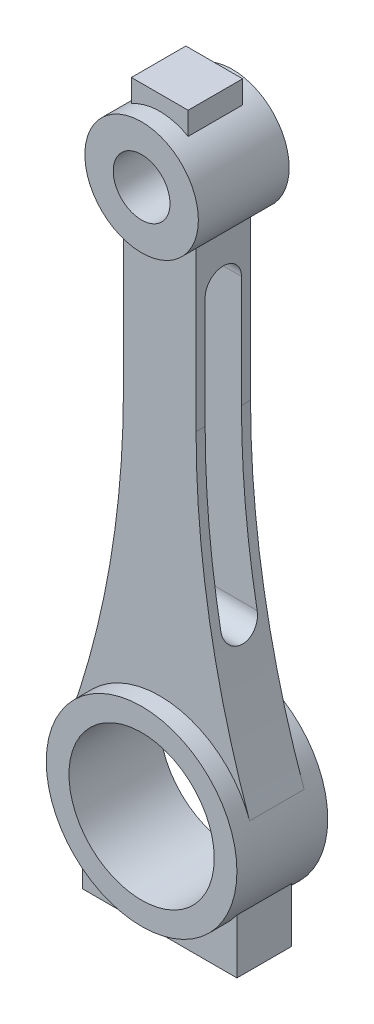
ISO-10303-21;
HEADER;
FILE_DESCRIPTION(('STEP AP214'),'2;1');
FILE_NAME('part.step','',(''),(''),'','','');
FILE_SCHEMA(('AUTOMOTIVE_DESIGN { 1 0 10303 214 1 1 1 1 }'));
ENDSEC;
DATA;
#1=APPLICATION_CONTEXT('core data for automotive mechanical design processes');
#2=APPLICATION_PROTOCOL_DEFINITION('international standard','automotive_design',2000,#1);
#3=PRODUCT_CONTEXT('',#1,'mechanical');
#4=PRODUCT('Part','Part','',(#3));
#5=PRODUCT_RELATED_PRODUCT_CATEGORY('part','',(#4));
#6=PRODUCT_DEFINITION_FORMATION('','',#4);
#7=PRODUCT_DEFINITION_CONTEXT('part definition',#1,'design');
#8=PRODUCT_DEFINITION('design','',#6,#7);
#9=PRODUCT_DEFINITION_SHAPE('','',#8);
#10=(LENGTH_UNIT() NAMED_UNIT(*) SI_UNIT(.MILLI.,.METRE.));
#11=(NAMED_UNIT(*) PLANE_ANGLE_UNIT() SI_UNIT($,.RADIAN.));
#12=(NAMED_UNIT(*) SI_UNIT($,.STERADIAN.) SOLID_ANGLE_UNIT());
#13=UNCERTAINTY_MEASURE_WITH_UNIT(LENGTH_MEASURE(1.E-05),#10,'distance_accuracy_value','');
#14=(GEOMETRIC_REPRESENTATION_CONTEXT(3) GLOBAL_UNCERTAINTY_ASSIGNED_CONTEXT((#13)) GLOBAL_UNIT_ASSIGNED_CONTEXT((#10,
#11,#12)) REPRESENTATION_CONTEXT('',''));
#15=CARTESIAN_POINT('',(0.,0.,0.));
#16=DIRECTION('',(0.,0.,1.));
#17=DIRECTION('',(1.,0.,0.));
#18=AXIS2_PLACEMENT_3D('',#15,#16,#17);
#19=CARTESIAN_POINT('',(0.,0.,10.));
#20=DIRECTION('',(0.,0.,-1.));
#21=DIRECTION('',(-1.,0.,0.));
#22=AXIS2_PLACEMENT_3D('',#19,#20,#21);
#23=CYLINDRICAL_SURFACE('',#22,16.);
#24=CARTESIAN_POINT('',(0.,0.,10.));
#25=DIRECTION('',(0.,0.,1.));
#26=DIRECTION('',(1.,0.,0.));
#27=AXIS2_PLACEMENT_3D('',#24,#25,#26);
#28=CIRCLE('',#27,16.);
#29=CARTESIAN_POINT('',(16.,0.,10.));
#30=VERTEX_POINT('',#29);
#31=EDGE_CURVE('E264',#30,#30,#28,.T.);
#32=ORIENTED_EDGE('',*,*,#31,.T.);
#33=EDGE_LOOP('',(#32));
#34=FACE_BOUND('',#33,.T.);
#35=CARTESIAN_POINT('',(0.,0.,-10.));
#36=DIRECTION('',(0.,0.,1.));
#37=DIRECTION('',(1.,0.,0.));
#38=AXIS2_PLACEMENT_3D('',#35,#36,#37);
#39=CIRCLE('',#38,16.);
#40=CARTESIAN_POINT('',(16.,0.,-10.));
#41=VERTEX_POINT('',#40);
#42=EDGE_CURVE('E267',#41,#41,#39,.T.);
#43=ORIENTED_EDGE('',*,*,#42,.F.);
#44=EDGE_LOOP('',(#43));
#45=FACE_BOUND('',#44,.T.);
#46=ADVANCED_FACE('F41',(#34,#45),#23,.F.);
#47=CARTESIAN_POINT('',(0.,0.,10.));
#48=DIRECTION('',(0.,0.,-1.));
#49=DIRECTION('',(-1.,0.,0.));
#50=AXIS2_PLACEMENT_3D('',#47,#48,#49);
#51=CYLINDRICAL_SURFACE('',#50,21.);
#52=DIRECTION('',(0.,0.,-1.));
#53=VECTOR('',#52,1.);
#54=CARTESIAN_POINT('',(-17.,-12.328828005938,6.));
#55=LINE('',#54,#53);
#56=CARTESIAN_POINT('',(-17.,-12.328828005938,6.));
#57=VERTEX_POINT('',#56);
#58=CARTESIAN_POINT('',(-17.,-12.328828005938,-6.));
#59=VERTEX_POINT('',#58);
#60=EDGE_CURVE('E398',#57,#59,#55,.T.);
#61=ORIENTED_EDGE('',*,*,#60,.F.);
#62=CARTESIAN_POINT('',(0.,0.,6.));
#63=DIRECTION('',(0.,0.,1.));
#64=DIRECTION('',(1.,0.,0.));
#65=AXIS2_PLACEMENT_3D('',#62,#63,#64);
#66=CIRCLE('',#65,21.);
#67=CARTESIAN_POINT('',(17.,-12.3288280059379,6.));
#68=VERTEX_POINT('',#67);
#69=EDGE_CURVE('E430',#57,#68,#66,.T.);
#70=ORIENTED_EDGE('',*,*,#69,.T.);
#71=DIRECTION('',(0.,0.,-1.));
#72=VECTOR('',#71,1.);
#73=CARTESIAN_POINT('',(17.,-12.328828005938,6.));
#74=LINE('',#73,#72);
#75=CARTESIAN_POINT('',(17.,-12.328828005938,-6.));
#76=VERTEX_POINT('',#75);
#77=EDGE_CURVE('E422',#68,#76,#74,.T.);
#78=ORIENTED_EDGE('',*,*,#77,.T.);
#79=CARTESIAN_POINT('',(0.,0.,-6.));
#80=DIRECTION('',(0.,0.,1.));
#81=DIRECTION('',(1.,0.,0.));
#82=AXIS2_PLACEMENT_3D('',#79,#80,#81);
#83=CIRCLE('',#82,21.);
#84=EDGE_CURVE('E438',#59,#76,#83,.T.);
#85=ORIENTED_EDGE('',*,*,#84,.F.);
#86=EDGE_LOOP('',(#61,#70,#78,#85));
#87=FACE_BOUND('',#86,.T.);
#88=DIRECTION('',(0.,0.,-1.));
#89=VECTOR('',#88,1.);
#90=CARTESIAN_POINT('',(19.7873824881444,7.03274443356765,6.));
#91=LINE('',#90,#89);
#92=CARTESIAN_POINT('',(19.7873824881444,7.03274443356766,6.));
#93=VERTEX_POINT('',#92);
#94=CARTESIAN_POINT('',(19.7873824881444,7.03274443356765,-6.));
#95=VERTEX_POINT('',#94);
#96=EDGE_CURVE('E271',#93,#95,#91,.T.);
#97=ORIENTED_EDGE('',*,*,#96,.F.);
#98=CARTESIAN_POINT('',(0.,0.,6.));
#99=DIRECTION('',(0.,0.,1.));
#100=DIRECTION('',(1.,0.,0.));
#101=AXIS2_PLACEMENT_3D('',#98,#99,#100);
#102=CIRCLE('',#101,21.);
#103=CARTESIAN_POINT('',(-19.7873824881444,7.03274443356765,6.));
#104=VERTEX_POINT('',#103);
#105=EDGE_CURVE('E309',#93,#104,#102,.T.);
#106=ORIENTED_EDGE('',*,*,#105,.T.);
#107=DIRECTION('',(0.,0.,-1.));
#108=VECTOR('',#107,1.);
#109=CARTESIAN_POINT('',(-19.7873824881444,7.03274443356764,6.));
#110=LINE('',#109,#108);
#111=CARTESIAN_POINT('',(-19.7873824881444,7.03274443356764,-6.));
#112=VERTEX_POINT('',#111);
#113=EDGE_CURVE('E301',#104,#112,#110,.T.);
#114=ORIENTED_EDGE('',*,*,#113,.T.);
#115=CARTESIAN_POINT('',(0.,0.,-6.));
#116=DIRECTION('',(0.,0.,1.));
#117=DIRECTION('',(1.,0.,0.));
#118=AXIS2_PLACEMENT_3D('',#115,#116,#117);
#119=CIRCLE('',#118,21.);
#120=EDGE_CURVE('E326',#95,#112,#119,.T.);
#121=ORIENTED_EDGE('',*,*,#120,.F.);
#122=EDGE_LOOP('',(#97,#106,#114,#121));
#123=FACE_BOUND('',#122,.T.);
#124=CARTESIAN_POINT('',(0.,0.,10.));
#125=DIRECTION('',(0.,0.,1.));
#126=DIRECTION('',(1.,0.,0.));
#127=AXIS2_PLACEMENT_3D('',#124,#125,#126);
#128=CIRCLE('',#127,21.);
#129=CARTESIAN_POINT('',(21.,0.,10.));
#130=VERTEX_POINT('',#129);
#131=EDGE_CURVE('E280',#130,#130,#128,.T.);
#132=ORIENTED_EDGE('',*,*,#131,.F.);
#133=EDGE_LOOP('',(#132));
#134=FACE_BOUND('',#133,.T.);
#135=CARTESIAN_POINT('',(0.,0.,-10.));
#136=DIRECTION('',(0.,0.,1.));
#137=DIRECTION('',(1.,0.,0.));
#138=AXIS2_PLACEMENT_3D('',#135,#136,#137);
#139=CIRCLE('',#138,21.);
#140=CARTESIAN_POINT('',(21.,0.,-10.));
#141=VERTEX_POINT('',#140);
#142=EDGE_CURVE('E270',#141,#141,#139,.T.);
#143=ORIENTED_EDGE('',*,*,#142,.T.);
#144=EDGE_LOOP('',(#143));
#145=FACE_BOUND('',#144,.T.);
#146=ADVANCED_FACE('F254',(#87,#123,#134,#145),#51,.T.);
#147=CARTESIAN_POINT('',(0.,0.,10.));
#148=DIRECTION('',(0.,0.,1.));
#149=DIRECTION('',(1.,0.,0.));
#150=AXIS2_PLACEMENT_3D('',#147,#148,#149);
#151=PLANE('',#150);
#152=ORIENTED_EDGE('',*,*,#31,.F.);
#153=EDGE_LOOP('',(#152));
#154=FACE_BOUND('',#153,.T.);
#155=ORIENTED_EDGE('',*,*,#131,.T.);
#156=EDGE_LOOP('',(#155));
#157=FACE_BOUND('',#156,.T.);
#158=ADVANCED_FACE('F259',(#154,#157),#151,.T.);
#159=CARTESIAN_POINT('',(0.,0.,-10.));
#160=DIRECTION('',(0.,0.,1.));
#161=DIRECTION('',(1.,0.,0.));
#162=AXIS2_PLACEMENT_3D('',#159,#160,#161);
#163=PLANE('',#162);
#164=ORIENTED_EDGE('',*,*,#42,.T.);
#165=EDGE_LOOP('',(#164));
#166=FACE_BOUND('',#165,.T.);
#167=ORIENTED_EDGE('',*,*,#142,.F.);
#168=EDGE_LOOP('',(#167));
#169=FACE_BOUND('',#168,.T.);
#170=ADVANCED_FACE('F251',(#166,#169),#163,.F.);
#171=CARTESIAN_POINT('',(212.132819979024,75.3953136438508,6.));
#172=DIRECTION('',(0.,0.,-1.));
#173=DIRECTION('',(-1.,0.,0.));
#174=AXIS2_PLACEMENT_3D('',#171,#172,#173);
#175=CYLINDRICAL_SURFACE('',#174,204.132819979024);
#176=CARTESIAN_POINT('',(212.132819979024,75.3953136438508,-4.));
#177=DIRECTION('',(0.,0.,-1.));
#178=DIRECTION('',(0.,1.,0.));
#179=AXIS2_PLACEMENT_3D('',#176,#177,#178);
#180=CIRCLE('',#179,204.132819979024);
#181=CARTESIAN_POINT('',(11.4544735884215,38.,-4.00000000000001));
#182=VERTEX_POINT('',#181);
#183=CARTESIAN_POINT('',(8.00000000000002,75.3953136438507,-4.));
#184=VERTEX_POINT('',#183);
#185=EDGE_CURVE('E197',#182,#184,#180,.T.);
#186=ORIENTED_EDGE('',*,*,#185,.F.);
#187=CARTESIAN_POINT('',(11.4544735884215,38.,3.99999999999999));
#188=CARTESIAN_POINT('',(11.4757515518411,37.8858086335559,4.00000967356234));
#189=CARTESIAN_POINT('',(11.497127848932,37.7716411229783,3.99511012112078));
#190=CARTESIAN_POINT('',(11.5399210356049,37.544152772884,3.97557755361703));
#191=CARTESIAN_POINT('',(11.5613379239584,37.4308319082382,3.96094482861378));
#192=CARTESIAN_POINT('',(11.6040518019029,37.2058589467753,3.92203609087537));
#193=CARTESIAN_POINT('',(11.6253488219803,37.0942064124742,3.89776265395076));
#194=CARTESIAN_POINT('',(11.6676599337569,36.8733657612217,3.83975872762629));
#195=CARTESIAN_POINT('',(11.688674029376,36.7641776101131,3.80602836938935));
#196=CARTESIAN_POINT('',(11.7510730473326,36.4413470108117,3.69089420326937));
#197=CARTESIAN_POINT('',(11.7918289081029,36.2323636826891,3.59553432969806));
#198=CARTESIAN_POINT('',(11.8702126062764,35.833491871712,3.37027556179512));
#199=CARTESIAN_POINT('',(11.9078413597511,35.643597793309,3.24038682968161));
#200=CARTESIAN_POINT('',(11.9784728244352,35.2894796680367,2.95043691024398));
#201=CARTESIAN_POINT('',(12.0115036519544,35.1250988255321,2.79057453802654));
#202=CARTESIAN_POINT('',(12.0720036427705,34.8256035029566,2.44449926104123));
#203=CARTESIAN_POINT('',(12.0994724370193,34.6904909648341,2.25828460915732));
#204=CARTESIAN_POINT('',(12.1473413477104,34.4559602912754,1.86832249559896));
#205=CARTESIAN_POINT('',(12.1678582991115,34.3559510460777,1.664944991045));
#206=CARTESIAN_POINT('',(12.201667760202,34.1915558050773,1.24372237948286));
#207=CARTESIAN_POINT('',(12.2149615713728,34.1271633917176,1.0258798867516));
#208=CARTESIAN_POINT('',(12.2336033492388,34.0369591960168,0.586274812122694));
#209=CARTESIAN_POINT('',(12.2390950212482,34.0104496060439,0.364661335561843));
#210=CARTESIAN_POINT('',(12.2423732155319,33.9946184843632,-0.0799443502249533));
#211=CARTESIAN_POINT('',(12.2401601145853,34.0052951341723,-0.302936491499047));
#212=CARTESIAN_POINT('',(12.2281765408432,34.0632127244266,-0.741781925824328));
#213=CARTESIAN_POINT('',(12.2184766498272,34.1101121767816,-0.957682365575716));
#214=CARTESIAN_POINT('',(12.1919895794175,34.2385791029979,-1.37844153266759));
#215=CARTESIAN_POINT('',(12.1752023313576,34.3201469127454,-1.58330015300716));
#216=CARTESIAN_POINT('',(12.1350793834177,34.5159552856904,-1.97739776157501));
#217=CARTESIAN_POINT('',(12.1117098081663,34.6303649264094,-2.16654921549124));
#218=CARTESIAN_POINT('',(12.0593260749273,34.8882465100265,-2.52297125984128));
#219=CARTESIAN_POINT('',(12.0303117725959,35.0317191961119,-2.69024129055299));
#220=CARTESIAN_POINT('',(11.9671383735568,35.3461665633751,-3.00114206510915));
#221=CARTESIAN_POINT('',(11.9329025496515,35.5175545383741,-3.1443390498194));
#222=CARTESIAN_POINT('',(11.8607975408038,35.8812712267655,-3.40006280722766));
#223=CARTESIAN_POINT('',(11.8229268395298,36.0736086840292,-3.51257670427657));
#224=CARTESIAN_POINT('',(11.744011046999,36.4777513253325,-3.70593438635493));
#225=CARTESIAN_POINT('',(11.7029182624971,36.6898643551292,-3.78611370956409));
#226=CARTESIAN_POINT('',(11.619535719839,37.1241795414682,-3.90944320644276));
#227=CARTESIAN_POINT('',(11.5772477716993,37.3463667203578,-3.95264656840456));
#228=CARTESIAN_POINT('',(11.5215540274852,37.6417241762258,-3.98457340087696));
#229=CARTESIAN_POINT('',(11.5080944382149,37.713314753212,-3.9903611181727));
#230=CARTESIAN_POINT('',(11.4812368188341,37.8565916807734,-3.99806924003838));
#231=CARTESIAN_POINT('',(11.467838723541,37.9282776734255,-3.99999606757806));
#232=CARTESIAN_POINT('',(11.4544735884215,38.,-4.00000000000001));
#233=B_SPLINE_CURVE_WITH_KNOTS('',3,(#187,#188,#189,#190,#191,#192,#193,#194,#195,#196,#197,
#198,#199,#200,#201,#202,#203,#204,#205,#206,#207,#208,#209,#210,#211,#212,#213,#214,#215,#216,
#217,#218,#219,#220,#221,#222,#223,#224,#225,#226,#227,#228,#229,#230,#231,#232),.UNSPECIFIED.,
.F.,.F.,(4,2,2,2,2,2,2,2,2,2,2,2,2,2,2,2,2,2,2,2,2,2,4),(0.,0.348357600629768,0.696704820295746,
1.044959030908,1.39320841164154,2.0894785742732,2.78554404346983,3.47714614167072,
4.16879411353829,4.84816302804555,5.52740949173435,6.19397531687088,6.86050854603355,
7.52083364695974,8.18116514562693,8.84495910470897,9.508770040179,10.1834922182609,
10.8584970981523,11.546741507572,12.2339942357505,12.4531452672714,12.6719314158043),.UNSPECIFIED.);
#234=CARTESIAN_POINT('',(11.4544735884215,38.,3.99999999999999));
#235=VERTEX_POINT('',#234);
#236=EDGE_CURVE('E182',#235,#182,#233,.T.);
#237=ORIENTED_EDGE('',*,*,#236,.F.);
#238=CARTESIAN_POINT('',(212.132819979024,75.3953136438508,4.));
#239=DIRECTION('',(0.,0.,1.));
#240=DIRECTION('',(0.,-1.,0.));
#241=AXIS2_PLACEMENT_3D('',#238,#239,#240);
#242=CIRCLE('',#241,204.132819979024);
#243=CARTESIAN_POINT('',(8.00000000000002,75.3953136438507,4.));
#244=VERTEX_POINT('',#243);
#245=EDGE_CURVE('E174',#244,#235,#242,.T.);
#246=ORIENTED_EDGE('',*,*,#245,.F.);
#247=DIRECTION('',(0.,0.,-1.));
#248=VECTOR('',#247,1.);
#249=CARTESIAN_POINT('',(8.00000000000002,75.3953136438507,6.));
#250=LINE('',#249,#248);
#251=CARTESIAN_POINT('',(8.00000000000002,75.3953136438507,6.));
#252=VERTEX_POINT('',#251);
#253=EDGE_CURVE('E277',#252,#244,#250,.T.);
#254=ORIENTED_EDGE('',*,*,#253,.F.);
#255=CARTESIAN_POINT('',(212.132819979024,75.3953136438508,6.));
#256=DIRECTION('',(0.,0.,1.));
#257=DIRECTION('',(1.,0.,0.));
#258=AXIS2_PLACEMENT_3D('',#255,#256,#257);
#259=CIRCLE('',#258,204.132819979024);
#260=EDGE_CURVE('E345',#252,#93,#259,.T.);
#261=ORIENTED_EDGE('',*,*,#260,.T.);
#262=ORIENTED_EDGE('',*,*,#96,.T.);
#263=CARTESIAN_POINT('',(212.132819979024,75.3953136438508,-6.));
#264=DIRECTION('',(0.,0.,1.));
#265=DIRECTION('',(1.,0.,0.));
#266=AXIS2_PLACEMENT_3D('',#263,#264,#265);
#267=CIRCLE('',#266,204.132819979024);
#268=CARTESIAN_POINT('',(8.00000000000002,75.3953136438507,-6.));
#269=VERTEX_POINT('',#268);
#270=EDGE_CURVE('E322',#269,#95,#267,.T.);
#271=ORIENTED_EDGE('',*,*,#270,.F.);
#272=EDGE_CURVE('E288',#184,#269,#250,.T.);
#273=ORIENTED_EDGE('',*,*,#272,.F.);
#274=EDGE_LOOP('',(#186,#237,#246,#254,#261,#262,#271,#273));
#275=FACE_BOUND('',#274,.T.);
#276=ADVANCED_FACE('F195',(#275),#175,.F.);
#277=CARTESIAN_POINT('',(8.00000000000008,0.,6.));
#278=DIRECTION('',(-1.,0.,0.));
#279=DIRECTION('',(0.,-1.,0.));
#280=AXIS2_PLACEMENT_3D('',#277,#278,#279);
#281=PLANE('',#280);
#282=CARTESIAN_POINT('',(8.00000000000001,100.,0.));
#283=DIRECTION('',(-1.,0.,0.));
#284=DIRECTION('',(0.,-1.,0.));
#285=AXIS2_PLACEMENT_3D('',#282,#283,#284);
#286=CIRCLE('',#285,4.);
#287=CARTESIAN_POINT('',(8.00000000000001,100.,4.));
#288=VERTEX_POINT('',#287);
#289=CARTESIAN_POINT('',(8.00000000000001,100.,-4.));
#290=VERTEX_POINT('',#289);
#291=EDGE_CURVE('E442',#288,#290,#286,.T.);
#292=ORIENTED_EDGE('',*,*,#291,.T.);
#293=DIRECTION('',(0.,-1.,0.));
#294=VECTOR('',#293,1.);
#295=CARTESIAN_POINT('',(8.00000000000008,0.,-4.00000000000001));
#296=LINE('',#295,#294);
#297=EDGE_CURVE('E202',#290,#184,#296,.T.);
#298=ORIENTED_EDGE('',*,*,#297,.T.);
#299=ORIENTED_EDGE('',*,*,#272,.T.);
#300=DIRECTION('',(0.,1.,0.));
#301=VECTOR('',#300,1.);
#302=CARTESIAN_POINT('',(8.00000000000008,0.,-6.));
#303=LINE('',#302,#301);
#304=CARTESIAN_POINT('',(8.,110.395313643851,-6.));
#305=VERTEX_POINT('',#304);
#306=EDGE_CURVE('E318',#269,#305,#303,.T.);
#307=ORIENTED_EDGE('',*,*,#306,.T.);
#308=DIRECTION('',(0.,0.,-1.));
#309=VECTOR('',#308,1.);
#310=CARTESIAN_POINT('',(8.,110.395313643851,6.));
#311=LINE('',#310,#309);
#312=CARTESIAN_POINT('',(8.,110.395313643851,6.));
#313=VERTEX_POINT('',#312);
#314=EDGE_CURVE('E289',#313,#305,#311,.T.);
#315=ORIENTED_EDGE('',*,*,#314,.F.);
#316=DIRECTION('',(0.,1.,0.));
#317=VECTOR('',#316,1.);
#318=CARTESIAN_POINT('',(8.00000000000008,0.,6.));
#319=LINE('',#318,#317);
#320=EDGE_CURVE('E341',#252,#313,#319,.T.);
#321=ORIENTED_EDGE('',*,*,#320,.F.);
#322=ORIENTED_EDGE('',*,*,#253,.T.);
#323=DIRECTION('',(0.,1.,0.));
#324=VECTOR('',#323,1.);
#325=CARTESIAN_POINT('',(8.00000000000008,0.,3.99999999999999));
#326=LINE('',#325,#324);
#327=EDGE_CURVE('E177',#244,#288,#326,.T.);
#328=ORIENTED_EDGE('',*,*,#327,.T.);
#329=EDGE_LOOP('',(#292,#298,#299,#307,#315,#321,#322,#328));
#330=FACE_BOUND('',#329,.T.);
#331=ADVANCED_FACE('F244',(#330),#281,.F.);
#332=CARTESIAN_POINT('',(-8.00000000000004,0.,6.));
#333=DIRECTION('',(-1.,0.,0.));
#334=DIRECTION('',(0.,-1.,0.));
#335=AXIS2_PLACEMENT_3D('',#332,#333,#334);
#336=PLANE('',#335);
#337=DIRECTION('',(0.,-1.,0.));
#338=VECTOR('',#337,1.);
#339=CARTESIAN_POINT('',(-8.00000000000004,0.,-4.00000000000001));
#340=LINE('',#339,#338);
#341=CARTESIAN_POINT('',(-8.,100.,-4.));
#342=VERTEX_POINT('',#341);
#343=CARTESIAN_POINT('',(-7.99999999999995,75.3953136438507,-4.));
#344=VERTEX_POINT('',#343);
#345=EDGE_CURVE('E199',#342,#344,#340,.T.);
#346=ORIENTED_EDGE('',*,*,#345,.F.);
#347=CARTESIAN_POINT('',(-7.99999999999999,100.,0.));
#348=DIRECTION('',(-1.,0.,0.));
#349=DIRECTION('',(0.,-1.,0.));
#350=AXIS2_PLACEMENT_3D('',#347,#348,#349);
#351=CIRCLE('',#350,4.);
#352=CARTESIAN_POINT('',(-8.,100.,4.));
#353=VERTEX_POINT('',#352);
#354=EDGE_CURVE('E11',#353,#342,#351,.T.);
#355=ORIENTED_EDGE('',*,*,#354,.F.);
#356=DIRECTION('',(0.,1.,0.));
#357=VECTOR('',#356,1.);
#358=CARTESIAN_POINT('',(-8.00000000000004,0.,3.99999999999999));
#359=LINE('',#358,#357);
#360=CARTESIAN_POINT('',(-7.99999999999995,75.3953136438507,4.));
#361=VERTEX_POINT('',#360);
#362=EDGE_CURVE('E489',#361,#353,#359,.T.);
#363=ORIENTED_EDGE('',*,*,#362,.F.);
#364=DIRECTION('',(0.,0.,-1.));
#365=VECTOR('',#364,1.);
#366=CARTESIAN_POINT('',(-8.00000000000001,75.3953136438507,6.));
#367=LINE('',#366,#365);
#368=CARTESIAN_POINT('',(-8.00000000000001,75.3953136438507,6.));
#369=VERTEX_POINT('',#368);
#370=EDGE_CURVE('E296',#369,#361,#367,.T.);
#371=ORIENTED_EDGE('',*,*,#370,.F.);
#372=DIRECTION('',(0.,1.,0.));
#373=VECTOR('',#372,1.);
#374=CARTESIAN_POINT('',(-8.00000000000004,0.,6.));
#375=LINE('',#374,#373);
#376=CARTESIAN_POINT('',(-7.99999999999999,110.395313643851,6.));
#377=VERTEX_POINT('',#376);
#378=EDGE_CURVE('E334',#369,#377,#375,.T.);
#379=ORIENTED_EDGE('',*,*,#378,.T.);
#380=DIRECTION('',(0.,0.,-1.));
#381=VECTOR('',#380,1.);
#382=CARTESIAN_POINT('',(-7.99999999999999,110.395313643851,6.));
#383=LINE('',#382,#381);
#384=CARTESIAN_POINT('',(-7.99999999999999,110.395313643851,-6.));
#385=VERTEX_POINT('',#384);
#386=EDGE_CURVE('E292',#377,#385,#383,.T.);
#387=ORIENTED_EDGE('',*,*,#386,.T.);
#388=DIRECTION('',(0.,1.,0.));
#389=VECTOR('',#388,1.);
#390=CARTESIAN_POINT('',(-8.00000000000004,0.,-6.));
#391=LINE('',#390,#389);
#392=CARTESIAN_POINT('',(-8.00000000000001,75.3953136438507,-6.));
#393=VERTEX_POINT('',#392);
#394=EDGE_CURVE('E310',#393,#385,#391,.T.);
#395=ORIENTED_EDGE('',*,*,#394,.F.);
#396=EDGE_CURVE('E300',#344,#393,#367,.T.);
#397=ORIENTED_EDGE('',*,*,#396,.F.);
#398=EDGE_LOOP('',(#346,#355,#363,#371,#379,#387,#395,#397));
#399=FACE_BOUND('',#398,.T.);
#400=ADVANCED_FACE('F239',(#399),#336,.T.);
#401=CARTESIAN_POINT('',(-212.132819979024,75.3953136438507,6.));
#402=DIRECTION('',(0.,0.,-1.));
#403=DIRECTION('',(-1.,0.,0.));
#404=AXIS2_PLACEMENT_3D('',#401,#402,#403);
#405=CYLINDRICAL_SURFACE('',#404,204.132819979024);
#406=CARTESIAN_POINT('',(-11.4544735884215,38.,3.99999999999999));
#407=CARTESIAN_POINT('',(-11.4757515518411,37.8858086335559,4.00000967356234));
#408=CARTESIAN_POINT('',(-11.4971278489319,37.7716411229782,3.99511012112078));
#409=CARTESIAN_POINT('',(-11.5399210356049,37.5441527728839,3.97557755361703));
#410=CARTESIAN_POINT('',(-11.5613379239584,37.4308319082382,3.96094482861378));
#411=CARTESIAN_POINT('',(-11.6040518019029,37.2058589467753,3.92203609087537));
#412=CARTESIAN_POINT('',(-11.6253488219802,37.0942064124742,3.89776265395076));
#413=CARTESIAN_POINT('',(-11.6676599337569,36.8733657612217,3.83975872762629));
#414=CARTESIAN_POINT('',(-11.6886740293759,36.7641776101131,3.80602836938935));
#415=CARTESIAN_POINT('',(-11.7510730473326,36.4413470108117,3.69089420326937));
#416=CARTESIAN_POINT('',(-11.7918289081029,36.2323636826891,3.59553432969806));
#417=CARTESIAN_POINT('',(-11.8702126062764,35.833491871712,3.37027556179512));
#418=CARTESIAN_POINT('',(-11.9078413597511,35.643597793309,3.24038682968162));
#419=CARTESIAN_POINT('',(-11.9784728244352,35.2894796680367,2.95043691024399));
#420=CARTESIAN_POINT('',(-12.0115036519544,35.1250988255321,2.79057453802654));
#421=CARTESIAN_POINT('',(-12.0720036427705,34.8256035029566,2.44449926104123));
#422=CARTESIAN_POINT('',(-12.0994724370193,34.6904909648341,2.25828460915732));
#423=CARTESIAN_POINT('',(-12.1473413477104,34.4559602912754,1.86832249559895));
#424=CARTESIAN_POINT('',(-12.1678582991115,34.3559510460777,1.66494499104499));
#425=CARTESIAN_POINT('',(-12.201667760202,34.1915558050773,1.24372237948286));
#426=CARTESIAN_POINT('',(-12.2149615713728,34.1271633917176,1.02587988675159));
#427=CARTESIAN_POINT('',(-12.2336033492387,34.0369591960168,0.586274812122688));
#428=CARTESIAN_POINT('',(-12.2390950212481,34.0104496060439,0.364661335561838));
#429=CARTESIAN_POINT('',(-12.2423732155318,33.9946184843632,-0.0799443502249568));
#430=CARTESIAN_POINT('',(-12.2401601145852,34.0052951341723,-0.302936491499049));
#431=CARTESIAN_POINT('',(-12.2281765408432,34.0632127244266,-0.741781925824329));
#432=CARTESIAN_POINT('',(-12.2184766498272,34.1101121767816,-0.957682365575717));
#433=CARTESIAN_POINT('',(-12.1919895794175,34.2385791029979,-1.3784415326676));
#434=CARTESIAN_POINT('',(-12.1752023313576,34.3201469127454,-1.58330015300716));
#435=CARTESIAN_POINT('',(-12.1350793834177,34.5159552856904,-1.97739776157502));
#436=CARTESIAN_POINT('',(-12.1117098081663,34.6303649264094,-2.16654921549124));
#437=CARTESIAN_POINT('',(-12.0593260749272,34.8882465100265,-2.52297125984129));
#438=CARTESIAN_POINT('',(-12.0303117725958,35.0317191961119,-2.690241290553));
#439=CARTESIAN_POINT('',(-11.9671383735568,35.3461665633751,-3.00114206510916));
#440=CARTESIAN_POINT('',(-11.9329025496515,35.5175545383741,-3.14433904981941));
#441=CARTESIAN_POINT('',(-11.8607975408037,35.8812712267655,-3.40006280722766));
#442=CARTESIAN_POINT('',(-11.8229268395298,36.0736086840292,-3.51257670427658));
#443=CARTESIAN_POINT('',(-11.744011046999,36.4777513253325,-3.70593438635493));
#444=CARTESIAN_POINT('',(-11.702918262497,36.6898643551292,-3.78611370956409));
#445=CARTESIAN_POINT('',(-11.6195357198389,37.1241795414682,-3.90944320644275));
#446=CARTESIAN_POINT('',(-11.5772477716992,37.3463667203578,-3.95264656840456));
#447=CARTESIAN_POINT('',(-11.5215540274852,37.6417241762258,-3.98457340087695));
#448=CARTESIAN_POINT('',(-11.5080944382148,37.713314753212,-3.9903611181727));
#449=CARTESIAN_POINT('',(-11.4812368188341,37.8565916807733,-3.99806924003838));
#450=CARTESIAN_POINT('',(-11.4678387235409,37.9282776734255,-3.99999606757806));
#451=CARTESIAN_POINT('',(-11.4544735884215,38.,-4.00000000000001));
#452=B_SPLINE_CURVE_WITH_KNOTS('',3,(#406,#407,#408,#409,#410,#411,#412,#413,#414,#415,#416,
#417,#418,#419,#420,#421,#422,#423,#424,#425,#426,#427,#428,#429,#430,#431,#432,#433,#434,#435,
#436,#437,#438,#439,#440,#441,#442,#443,#444,#445,#446,#447,#448,#449,#450,#451),.UNSPECIFIED.,
.F.,.F.,(4,2,2,2,2,2,2,2,2,2,2,2,2,2,2,2,2,2,2,2,2,2,4),(0.,0.348357600629779,0.696704820295753,
1.044959030908,1.39320841164154,2.0894785742732,2.78554404346982,3.47714614167071,
4.1687941135383,4.84816302804556,5.52740949173436,6.19397531687089,6.86050854603355,
7.52083364695974,8.18116514562693,8.84495910470897,9.50877004017901,10.1834922182609,
10.8584970981523,11.546741507572,12.2339942357505,12.4531452672714,12.6719314158043),.UNSPECIFIED.);
#453=CARTESIAN_POINT('',(-11.4544735884215,38.,3.99999999999999));
#454=VERTEX_POINT('',#453);
#455=CARTESIAN_POINT('',(-11.4544735884215,38.,-4.00000000000001));
#456=VERTEX_POINT('',#455);
#457=EDGE_CURVE('E189',#454,#456,#452,.T.);
#458=ORIENTED_EDGE('',*,*,#457,.T.);
#459=CARTESIAN_POINT('',(-212.132819979024,75.3953136438507,-4.));
#460=DIRECTION('',(0.,0.,-1.));
#461=DIRECTION('',(0.,1.,0.));
#462=AXIS2_PLACEMENT_3D('',#459,#460,#461);
#463=CIRCLE('',#462,204.132819979024);
#464=EDGE_CURVE('E49',#456,#344,#463,.F.);
#465=ORIENTED_EDGE('',*,*,#464,.T.);
#466=ORIENTED_EDGE('',*,*,#396,.T.);
#467=CARTESIAN_POINT('',(-212.132819979024,75.3953136438507,-6.));
#468=DIRECTION('',(0.,0.,1.));
#469=DIRECTION('',(1.,0.,0.));
#470=AXIS2_PLACEMENT_3D('',#467,#468,#469);
#471=CIRCLE('',#470,204.132819979024);
#472=EDGE_CURVE('E305',#393,#112,#471,.F.);
#473=ORIENTED_EDGE('',*,*,#472,.T.);
#474=ORIENTED_EDGE('',*,*,#113,.F.);
#475=CARTESIAN_POINT('',(-212.132819979024,75.3953136438507,6.));
#476=DIRECTION('',(0.,0.,1.));
#477=DIRECTION('',(1.,0.,0.));
#478=AXIS2_PLACEMENT_3D('',#475,#476,#477);
#479=CIRCLE('',#478,204.132819979024);
#480=EDGE_CURVE('E304',#369,#104,#479,.F.);
#481=ORIENTED_EDGE('',*,*,#480,.F.);
#482=ORIENTED_EDGE('',*,*,#370,.T.);
#483=CARTESIAN_POINT('',(-212.132819979024,75.3953136438507,4.));
#484=DIRECTION('',(0.,0.,1.));
#485=DIRECTION('',(0.,-1.,0.));
#486=AXIS2_PLACEMENT_3D('',#483,#484,#485);
#487=CIRCLE('',#486,204.132819979024);
#488=EDGE_CURVE('E231',#361,#454,#487,.F.);
#489=ORIENTED_EDGE('',*,*,#488,.T.);
#490=EDGE_LOOP('',(#458,#465,#466,#473,#474,#481,#482,#489));
#491=FACE_BOUND('',#490,.T.);
#492=ADVANCED_FACE('F233',(#491),#405,.F.);
#493=CARTESIAN_POINT('',(0.,0.,6.));
#494=DIRECTION('',(0.,0.,1.));
#495=DIRECTION('',(1.,0.,0.));
#496=AXIS2_PLACEMENT_3D('',#493,#494,#495);
#497=PLANE('',#496);
#498=ORIENTED_EDGE('',*,*,#105,.F.);
#499=ORIENTED_EDGE('',*,*,#260,.F.);
#500=ORIENTED_EDGE('',*,*,#320,.T.);
#501=CARTESIAN_POINT('',(0.,120.,6.));
#502=DIRECTION('',(0.,0.,1.));
#503=DIRECTION('',(1.,0.,0.));
#504=AXIS2_PLACEMENT_3D('',#501,#502,#503);
#505=CIRCLE('',#504,12.5);
#506=EDGE_CURVE('E338',#377,#313,#505,.T.);
#507=ORIENTED_EDGE('',*,*,#506,.F.);
#508=ORIENTED_EDGE('',*,*,#378,.F.);
#509=ORIENTED_EDGE('',*,*,#480,.T.);
#510=EDGE_LOOP('',(#498,#499,#500,#507,#508,#509));
#511=FACE_BOUND('',#510,.T.);
#512=ADVANCED_FACE('F238',(#511),#497,.T.);
#513=CARTESIAN_POINT('',(0.,0.,-6.));
#514=DIRECTION('',(0.,0.,1.));
#515=DIRECTION('',(1.,0.,0.));
#516=AXIS2_PLACEMENT_3D('',#513,#514,#515);
#517=PLANE('',#516);
#518=ORIENTED_EDGE('',*,*,#120,.T.);
#519=ORIENTED_EDGE('',*,*,#472,.F.);
#520=ORIENTED_EDGE('',*,*,#394,.T.);
#521=CARTESIAN_POINT('',(0.,120.,-6.));
#522=DIRECTION('',(0.,0.,1.));
#523=DIRECTION('',(1.,0.,0.));
#524=AXIS2_PLACEMENT_3D('',#521,#522,#523);
#525=CIRCLE('',#524,12.5);
#526=EDGE_CURVE('E314',#385,#305,#525,.T.);
#527=ORIENTED_EDGE('',*,*,#526,.T.);
#528=ORIENTED_EDGE('',*,*,#306,.F.);
#529=ORIENTED_EDGE('',*,*,#270,.T.);
#530=EDGE_LOOP('',(#518,#519,#520,#527,#528,#529));
#531=FACE_BOUND('',#530,.T.);
#532=ADVANCED_FACE('F241',(#531),#517,.F.);
#533=CARTESIAN_POINT('',(0.,120.,10.));
#534=DIRECTION('',(0.,0.,-1.));
#535=DIRECTION('',(-1.,0.,0.));
#536=AXIS2_PLACEMENT_3D('',#533,#534,#535);
#537=CYLINDRICAL_SURFACE('',#536,6.25);
#538=CARTESIAN_POINT('',(0.,120.,10.));
#539=DIRECTION('',(0.,0.,1.));
#540=DIRECTION('',(1.,0.,0.));
#541=AXIS2_PLACEMENT_3D('',#538,#539,#540);
#542=CIRCLE('',#541,6.25);
#543=CARTESIAN_POINT('',(6.25,120.,10.));
#544=VERTEX_POINT('',#543);
#545=EDGE_CURVE('E355',#544,#544,#542,.T.);
#546=ORIENTED_EDGE('',*,*,#545,.T.);
#547=EDGE_LOOP('',(#546));
#548=FACE_BOUND('',#547,.T.);
#549=CARTESIAN_POINT('',(0.,120.,-10.));
#550=DIRECTION('',(0.,0.,1.));
#551=DIRECTION('',(1.,0.,0.));
#552=AXIS2_PLACEMENT_3D('',#549,#550,#551);
#553=CIRCLE('',#552,6.25);
#554=CARTESIAN_POINT('',(6.25,120.,-10.));
#555=VERTEX_POINT('',#554);
#556=EDGE_CURVE('E356',#555,#555,#553,.T.);
#557=ORIENTED_EDGE('',*,*,#556,.F.);
#558=EDGE_LOOP('',(#557));
#559=FACE_BOUND('',#558,.T.);
#560=ADVANCED_FACE('F557',(#548,#559),#537,.F.);
#561=CARTESIAN_POINT('',(0.,120.,10.));
#562=DIRECTION('',(0.,0.,-1.));
#563=DIRECTION('',(-1.,0.,0.));
#564=AXIS2_PLACEMENT_3D('',#561,#562,#563);
#565=CYLINDRICAL_SURFACE('',#564,12.5);
#566=DIRECTION('',(0.,0.,-1.));
#567=VECTOR('',#566,1.);
#568=CARTESIAN_POINT('',(6.25,130.825317547305,6.));
#569=LINE('',#568,#567);
#570=CARTESIAN_POINT('',(6.25,130.825317547305,6.));
#571=VERTEX_POINT('',#570);
#572=CARTESIAN_POINT('',(6.25,130.825317547305,-6.));
#573=VERTEX_POINT('',#572);
#574=EDGE_CURVE('E373',#571,#573,#569,.T.);
#575=ORIENTED_EDGE('',*,*,#574,.F.);
#576=CARTESIAN_POINT('',(0.,120.,6.));
#577=DIRECTION('',(0.,0.,1.));
#578=DIRECTION('',(1.,0.,0.));
#579=AXIS2_PLACEMENT_3D('',#576,#577,#578);
#580=CIRCLE('',#579,12.5);
#581=CARTESIAN_POINT('',(-6.25,130.825317547305,6.));
#582=VERTEX_POINT('',#581);
#583=EDGE_CURVE('E402',#571,#582,#580,.T.);
#584=ORIENTED_EDGE('',*,*,#583,.T.);
#585=DIRECTION('',(0.,0.,-1.));
#586=VECTOR('',#585,1.);
#587=CARTESIAN_POINT('',(-6.25,130.825317547305,6.));
#588=LINE('',#587,#586);
#589=CARTESIAN_POINT('',(-6.25,130.825317547305,-6.));
#590=VERTEX_POINT('',#589);
#591=EDGE_CURVE('E370',#582,#590,#588,.T.);
#592=ORIENTED_EDGE('',*,*,#591,.T.);
#593=CARTESIAN_POINT('',(0.,120.,-6.));
#594=DIRECTION('',(0.,0.,1.));
#595=DIRECTION('',(1.,0.,0.));
#596=AXIS2_PLACEMENT_3D('',#593,#594,#595);
#597=CIRCLE('',#596,12.5);
#598=EDGE_CURVE('E386',#573,#590,#597,.T.);
#599=ORIENTED_EDGE('',*,*,#598,.F.);
#600=EDGE_LOOP('',(#575,#584,#592,#599));
#601=FACE_BOUND('',#600,.T.);
#602=ORIENTED_EDGE('',*,*,#506,.T.);
#603=ORIENTED_EDGE('',*,*,#314,.T.);
#604=ORIENTED_EDGE('',*,*,#526,.F.);
#605=ORIENTED_EDGE('',*,*,#386,.F.);
#606=EDGE_LOOP('',(#602,#603,#604,#605));
#607=FACE_BOUND('',#606,.T.);
#608=CARTESIAN_POINT('',(0.,120.,10.));
#609=DIRECTION('',(0.,0.,1.));
#610=DIRECTION('',(1.,0.,0.));
#611=AXIS2_PLACEMENT_3D('',#608,#609,#610);
#612=CIRCLE('',#611,12.5);
#613=CARTESIAN_POINT('',(12.5,120.,10.));
#614=VERTEX_POINT('',#613);
#615=EDGE_CURVE('E330',#614,#614,#612,.T.);
#616=ORIENTED_EDGE('',*,*,#615,.F.);
#617=EDGE_LOOP('',(#616));
#618=FACE_BOUND('',#617,.T.);
#619=CARTESIAN_POINT('',(0.,120.,-10.));
#620=DIRECTION('',(0.,0.,1.));
#621=DIRECTION('',(1.,0.,0.));
#622=AXIS2_PLACEMENT_3D('',#619,#620,#621);
#623=CIRCLE('',#622,12.5);
#624=CARTESIAN_POINT('',(12.5,120.,-10.));
#625=VERTEX_POINT('',#624);
#626=EDGE_CURVE('E351',#625,#625,#623,.T.);
#627=ORIENTED_EDGE('',*,*,#626,.T.);
#628=EDGE_LOOP('',(#627));
#629=FACE_BOUND('',#628,.T.);
#630=ADVANCED_FACE('F477',(#601,#607,#618,#629),#565,.T.);
#631=CARTESIAN_POINT('',(0.,0.,10.));
#632=DIRECTION('',(0.,0.,1.));
#633=DIRECTION('',(1.,0.,0.));
#634=AXIS2_PLACEMENT_3D('',#631,#632,#633);
#635=PLANE('',#634);
#636=ORIENTED_EDGE('',*,*,#545,.F.);
#637=EDGE_LOOP('',(#636));
#638=FACE_BOUND('',#637,.T.);
#639=ORIENTED_EDGE('',*,*,#615,.T.);
#640=EDGE_LOOP('',(#639));
#641=FACE_BOUND('',#640,.T.);
#642=ADVANCED_FACE('F548',(#638,#641),#635,.T.);
#643=CARTESIAN_POINT('',(0.,0.,-10.));
#644=DIRECTION('',(0.,0.,1.));
#645=DIRECTION('',(1.,0.,0.));
#646=AXIS2_PLACEMENT_3D('',#643,#644,#645);
#647=PLANE('',#646);
#648=ORIENTED_EDGE('',*,*,#556,.T.);
#649=EDGE_LOOP('',(#648));
#650=FACE_BOUND('',#649,.T.);
#651=ORIENTED_EDGE('',*,*,#626,.F.);
#652=EDGE_LOOP('',(#651));
#653=FACE_BOUND('',#652,.T.);
#654=ADVANCED_FACE('F546',(#650,#653),#647,.F.);
#655=CARTESIAN_POINT('',(0.,135.825317547305,6.));
#656=DIRECTION('',(0.,-1.,0.));
#657=DIRECTION('',(0.,0.,-1.));
#658=AXIS2_PLACEMENT_3D('',#655,#656,#657);
#659=PLANE('',#658);
#660=DIRECTION('',(-1.,0.,0.));
#661=VECTOR('',#660,1.);
#662=CARTESIAN_POINT('',(0.,135.825317547305,-6.));
#663=LINE('',#662,#661);
#664=CARTESIAN_POINT('',(6.25,135.825317547305,-6.));
#665=VERTEX_POINT('',#664);
#666=CARTESIAN_POINT('',(-6.25,135.825317547305,-6.));
#667=VERTEX_POINT('',#666);
#668=EDGE_CURVE('E394',#665,#667,#663,.T.);
#669=ORIENTED_EDGE('',*,*,#668,.T.);
#670=DIRECTION('',(0.,0.,-1.));
#671=VECTOR('',#670,1.);
#672=CARTESIAN_POINT('',(-6.25,135.825317547305,6.));
#673=LINE('',#672,#671);
#674=CARTESIAN_POINT('',(-6.25,135.825317547305,6.));
#675=VERTEX_POINT('',#674);
#676=EDGE_CURVE('E360',#675,#667,#673,.T.);
#677=ORIENTED_EDGE('',*,*,#676,.F.);
#678=DIRECTION('',(-1.,0.,0.));
#679=VECTOR('',#678,1.);
#680=CARTESIAN_POINT('',(0.,135.825317547305,6.));
#681=LINE('',#680,#679);
#682=CARTESIAN_POINT('',(6.25,135.825317547305,6.));
#683=VERTEX_POINT('',#682);
#684=EDGE_CURVE('E385',#683,#675,#681,.T.);
#685=ORIENTED_EDGE('',*,*,#684,.F.);
#686=DIRECTION('',(0.,0.,-1.));
#687=VECTOR('',#686,1.);
#688=CARTESIAN_POINT('',(6.25,135.825317547305,6.));
#689=LINE('',#688,#687);
#690=EDGE_CURVE('E377',#683,#665,#689,.T.);
#691=ORIENTED_EDGE('',*,*,#690,.T.);
#692=EDGE_LOOP('',(#669,#677,#685,#691));
#693=FACE_BOUND('',#692,.T.);
#694=ADVANCED_FACE('F542',(#693),#659,.F.);
#695=CARTESIAN_POINT('',(-6.25000000000002,0.,6.));
#696=DIRECTION('',(1.,0.,0.));
#697=DIRECTION('',(0.,1.,0.));
#698=AXIS2_PLACEMENT_3D('',#695,#696,#697);
#699=PLANE('',#698);
#700=DIRECTION('',(0.,-1.,0.));
#701=VECTOR('',#700,1.);
#702=CARTESIAN_POINT('',(-6.25000000000002,0.,-6.));
#703=LINE('',#702,#701);
#704=EDGE_CURVE('E390',#667,#590,#703,.T.);
#705=ORIENTED_EDGE('',*,*,#704,.T.);
#706=ORIENTED_EDGE('',*,*,#591,.F.);
#707=DIRECTION('',(0.,-1.,0.));
#708=VECTOR('',#707,1.);
#709=CARTESIAN_POINT('',(-6.25000000000002,0.,6.));
#710=LINE('',#709,#708);
#711=EDGE_CURVE('E405',#675,#582,#710,.T.);
#712=ORIENTED_EDGE('',*,*,#711,.F.);
#713=ORIENTED_EDGE('',*,*,#676,.T.);
#714=EDGE_LOOP('',(#705,#706,#712,#713));
#715=FACE_BOUND('',#714,.T.);
#716=ADVANCED_FACE('F538',(#715),#699,.F.);
#717=CARTESIAN_POINT('',(6.25000000000007,0.,6.));
#718=DIRECTION('',(1.,0.,0.));
#719=DIRECTION('',(0.,1.,0.));
#720=AXIS2_PLACEMENT_3D('',#717,#718,#719);
#721=PLANE('',#720);
#722=DIRECTION('',(0.,-1.,0.));
#723=VECTOR('',#722,1.);
#724=CARTESIAN_POINT('',(6.25000000000007,0.,-6.));
#725=LINE('',#724,#723);
#726=EDGE_CURVE('E381',#665,#573,#725,.T.);
#727=ORIENTED_EDGE('',*,*,#726,.F.);
#728=ORIENTED_EDGE('',*,*,#690,.F.);
#729=DIRECTION('',(0.,-1.,0.));
#730=VECTOR('',#729,1.);
#731=CARTESIAN_POINT('',(6.25000000000007,0.,6.));
#732=LINE('',#731,#730);
#733=EDGE_CURVE('E380',#683,#571,#732,.T.);
#734=ORIENTED_EDGE('',*,*,#733,.T.);
#735=ORIENTED_EDGE('',*,*,#574,.T.);
#736=EDGE_LOOP('',(#727,#728,#734,#735));
#737=FACE_BOUND('',#736,.T.);
#738=ADVANCED_FACE('F531',(#737),#721,.T.);
#739=CARTESIAN_POINT('',(0.,0.,6.));
#740=DIRECTION('',(0.,0.,1.));
#741=DIRECTION('',(1.,0.,0.));
#742=AXIS2_PLACEMENT_3D('',#739,#740,#741);
#743=PLANE('',#742);
#744=ORIENTED_EDGE('',*,*,#684,.T.);
#745=ORIENTED_EDGE('',*,*,#711,.T.);
#746=ORIENTED_EDGE('',*,*,#583,.F.);
#747=ORIENTED_EDGE('',*,*,#733,.F.);
#748=EDGE_LOOP('',(#744,#745,#746,#747));
#749=FACE_BOUND('',#748,.T.);
#750=ADVANCED_FACE('F528',(#749),#743,.T.);
#751=CARTESIAN_POINT('',(0.,0.,-6.));
#752=DIRECTION('',(0.,0.,1.));
#753=DIRECTION('',(1.,0.,0.));
#754=AXIS2_PLACEMENT_3D('',#751,#752,#753);
#755=PLANE('',#754);
#756=ORIENTED_EDGE('',*,*,#668,.F.);
#757=ORIENTED_EDGE('',*,*,#726,.T.);
#758=ORIENTED_EDGE('',*,*,#598,.T.);
#759=ORIENTED_EDGE('',*,*,#704,.F.);
#760=EDGE_LOOP('',(#756,#757,#758,#759));
#761=FACE_BOUND('',#760,.T.);
#762=ADVANCED_FACE('F526',(#761),#755,.F.);
#763=CARTESIAN_POINT('',(-17.,0.,6.));
#764=DIRECTION('',(-1.,0.,0.));
#765=DIRECTION('',(0.,0.,1.));
#766=AXIS2_PLACEMENT_3D('',#763,#764,#765);
#767=PLANE('',#766);
#768=DIRECTION('',(0.,1.,0.));
#769=VECTOR('',#768,1.);
#770=CARTESIAN_POINT('',(-17.,0.,-6.));
#771=LINE('',#770,#769);
#772=CARTESIAN_POINT('',(-17.,-24.328828005938,-6.));
#773=VERTEX_POINT('',#772);
#774=EDGE_CURVE('E434',#773,#59,#771,.T.);
#775=ORIENTED_EDGE('',*,*,#774,.F.);
#776=DIRECTION('',(0.,0.,-1.));
#777=VECTOR('',#776,1.);
#778=CARTESIAN_POINT('',(-17.,-24.328828005938,6.));
#779=LINE('',#778,#777);
#780=CARTESIAN_POINT('',(-17.,-24.328828005938,6.));
#781=VERTEX_POINT('',#780);
#782=EDGE_CURVE('E415',#781,#773,#779,.T.);
#783=ORIENTED_EDGE('',*,*,#782,.F.);
#784=DIRECTION('',(0.,1.,0.));
#785=VECTOR('',#784,1.);
#786=CARTESIAN_POINT('',(-17.,0.,6.));
#787=LINE('',#786,#785);
#788=EDGE_CURVE('E449',#781,#57,#787,.T.);
#789=ORIENTED_EDGE('',*,*,#788,.T.);
#790=ORIENTED_EDGE('',*,*,#60,.T.);
#791=EDGE_LOOP('',(#775,#783,#789,#790));
#792=FACE_BOUND('',#791,.T.);
#793=ADVANCED_FACE('F522',(#792),#767,.T.);
#794=CARTESIAN_POINT('',(0.,-24.328828005938,6.));
#795=DIRECTION('',(0.,1.,0.));
#796=DIRECTION('',(-1.,0.,0.));
#797=AXIS2_PLACEMENT_3D('',#794,#795,#796);
#798=PLANE('',#797);
#799=DIRECTION('',(1.,0.,0.));
#800=VECTOR('',#799,1.);
#801=CARTESIAN_POINT('',(0.,-24.328828005938,-6.));
#802=LINE('',#801,#800);
#803=CARTESIAN_POINT('',(17.,-24.328828005938,-6.));
#804=VERTEX_POINT('',#803);
#805=EDGE_CURVE('E431',#773,#804,#802,.T.);
#806=ORIENTED_EDGE('',*,*,#805,.T.);
#807=DIRECTION('',(0.,0.,-1.));
#808=VECTOR('',#807,1.);
#809=CARTESIAN_POINT('',(17.,-24.328828005938,6.));
#810=LINE('',#809,#808);
#811=CARTESIAN_POINT('',(17.,-24.328828005938,6.));
#812=VERTEX_POINT('',#811);
#813=EDGE_CURVE('E418',#812,#804,#810,.T.);
#814=ORIENTED_EDGE('',*,*,#813,.F.);
#815=DIRECTION('',(1.,0.,0.));
#816=VECTOR('',#815,1.);
#817=CARTESIAN_POINT('',(0.,-24.328828005938,6.));
#818=LINE('',#817,#816);
#819=EDGE_CURVE('E446',#781,#812,#818,.T.);
#820=ORIENTED_EDGE('',*,*,#819,.F.);
#821=ORIENTED_EDGE('',*,*,#782,.T.);
#822=EDGE_LOOP('',(#806,#814,#820,#821));
#823=FACE_BOUND('',#822,.T.);
#824=ADVANCED_FACE('F518',(#823),#798,.F.);
#825=CARTESIAN_POINT('',(17.,0.,6.));
#826=DIRECTION('',(-1.,0.,0.));
#827=DIRECTION('',(0.,-1.,0.));
#828=AXIS2_PLACEMENT_3D('',#825,#826,#827);
#829=PLANE('',#828);
#830=DIRECTION('',(0.,1.,0.));
#831=VECTOR('',#830,1.);
#832=CARTESIAN_POINT('',(17.,0.,-6.));
#833=LINE('',#832,#831);
#834=EDGE_CURVE('E426',#804,#76,#833,.T.);
#835=ORIENTED_EDGE('',*,*,#834,.T.);
#836=ORIENTED_EDGE('',*,*,#77,.F.);
#837=DIRECTION('',(0.,1.,0.));
#838=VECTOR('',#837,1.);
#839=CARTESIAN_POINT('',(17.,0.,6.));
#840=LINE('',#839,#838);
#841=EDGE_CURVE('E425',#812,#68,#840,.T.);
#842=ORIENTED_EDGE('',*,*,#841,.F.);
#843=ORIENTED_EDGE('',*,*,#813,.T.);
#844=EDGE_LOOP('',(#835,#836,#842,#843));
#845=FACE_BOUND('',#844,.T.);
#846=ADVANCED_FACE('F513',(#845),#829,.F.);
#847=CARTESIAN_POINT('',(0.,0.,6.));
#848=DIRECTION('',(0.,0.,1.));
#849=DIRECTION('',(1.,0.,0.));
#850=AXIS2_PLACEMENT_3D('',#847,#848,#849);
#851=PLANE('',#850);
#852=ORIENTED_EDGE('',*,*,#69,.F.);
#853=ORIENTED_EDGE('',*,*,#788,.F.);
#854=ORIENTED_EDGE('',*,*,#819,.T.);
#855=ORIENTED_EDGE('',*,*,#841,.T.);
#856=EDGE_LOOP('',(#852,#853,#854,#855));
#857=FACE_BOUND('',#856,.T.);
#858=ADVANCED_FACE('F508',(#857),#851,.T.);
#859=CARTESIAN_POINT('',(0.,0.,-6.));
#860=DIRECTION('',(0.,0.,1.));
#861=DIRECTION('',(1.,0.,0.));
#862=AXIS2_PLACEMENT_3D('',#859,#860,#861);
#863=PLANE('',#862);
#864=ORIENTED_EDGE('',*,*,#84,.T.);
#865=ORIENTED_EDGE('',*,*,#834,.F.);
#866=ORIENTED_EDGE('',*,*,#805,.F.);
#867=ORIENTED_EDGE('',*,*,#774,.T.);
#868=EDGE_LOOP('',(#864,#865,#866,#867));
#869=FACE_BOUND('',#868,.T.);
#870=ADVANCED_FACE('F504',(#869),#863,.F.);
#871=CARTESIAN_POINT('',(-21.,100.,0.));
#872=DIRECTION('',(1.,0.,0.));
#873=DIRECTION('',(0.,0.,-1.));
#874=AXIS2_PLACEMENT_3D('',#871,#872,#873);
#875=CYLINDRICAL_SURFACE('',#874,4.);
#876=DIRECTION('',(1.,0.,0.));
#877=VECTOR('',#876,1.);
#878=CARTESIAN_POINT('',(-21.,100.,4.));
#879=LINE('',#878,#877);
#880=EDGE_CURVE('E56',#353,#288,#879,.T.);
#881=ORIENTED_EDGE('',*,*,#880,.F.);
#882=ORIENTED_EDGE('',*,*,#354,.T.);
#883=DIRECTION('',(1.,0.,0.));
#884=VECTOR('',#883,1.);
#885=CARTESIAN_POINT('',(-21.,100.,-4.));
#886=LINE('',#885,#884);
#887=EDGE_CURVE('E491',#342,#290,#886,.T.);
#888=ORIENTED_EDGE('',*,*,#887,.T.);
#889=ORIENTED_EDGE('',*,*,#291,.F.);
#890=EDGE_LOOP('',(#881,#882,#888,#889));
#891=FACE_BOUND('',#890,.T.);
#892=ADVANCED_FACE('F220',(#891),#875,.F.);
#893=CARTESIAN_POINT('',(-21.,38.,0.));
#894=DIRECTION('',(1.,0.,0.));
#895=DIRECTION('',(0.,0.,-1.));
#896=AXIS2_PLACEMENT_3D('',#893,#894,#895);
#897=CYLINDRICAL_SURFACE('',#896,4.);
#898=ORIENTED_EDGE('',*,*,#236,.T.);
#899=DIRECTION('',(1.,0.,0.));
#900=VECTOR('',#899,1.);
#901=CARTESIAN_POINT('',(-21.,38.,-4.00000000000001));
#902=LINE('',#901,#900);
#903=EDGE_CURVE('E192',#456,#182,#902,.T.);
#904=ORIENTED_EDGE('',*,*,#903,.F.);
#905=ORIENTED_EDGE('',*,*,#457,.F.);
#906=DIRECTION('',(1.,0.,0.));
#907=VECTOR('',#906,1.);
#908=CARTESIAN_POINT('',(-21.,38.,3.99999999999999));
#909=LINE('',#908,#907);
#910=EDGE_CURVE('E63',#454,#235,#909,.T.);
#911=ORIENTED_EDGE('',*,*,#910,.T.);
#912=EDGE_LOOP('',(#898,#904,#905,#911));
#913=FACE_BOUND('',#912,.T.);
#914=ADVANCED_FACE('F185',(#913),#897,.F.);
#915=CARTESIAN_POINT('',(-21.,100.,-4.));
#916=DIRECTION('',(0.,0.,-1.));
#917=DIRECTION('',(0.,1.,0.));
#918=AXIS2_PLACEMENT_3D('',#915,#916,#917);
#919=PLANE('',#918);
#920=ORIENTED_EDGE('',*,*,#185,.T.);
#921=ORIENTED_EDGE('',*,*,#297,.F.);
#922=ORIENTED_EDGE('',*,*,#887,.F.);
#923=ORIENTED_EDGE('',*,*,#345,.T.);
#924=ORIENTED_EDGE('',*,*,#464,.F.);
#925=ORIENTED_EDGE('',*,*,#903,.T.);
#926=EDGE_LOOP('',(#920,#921,#922,#923,#924,#925));
#927=FACE_BOUND('',#926,.T.);
#928=ADVANCED_FACE('F219',(#927),#919,.F.);
#929=CARTESIAN_POINT('',(-21.,100.,4.));
#930=DIRECTION('',(0.,0.,1.));
#931=DIRECTION('',(0.,-1.,0.));
#932=AXIS2_PLACEMENT_3D('',#929,#930,#931);
#933=PLANE('',#932);
#934=ORIENTED_EDGE('',*,*,#245,.T.);
#935=ORIENTED_EDGE('',*,*,#910,.F.);
#936=ORIENTED_EDGE('',*,*,#488,.F.);
#937=ORIENTED_EDGE('',*,*,#362,.T.);
#938=ORIENTED_EDGE('',*,*,#880,.T.);
#939=ORIENTED_EDGE('',*,*,#327,.F.);
#940=EDGE_LOOP('',(#934,#935,#936,#937,#938,#939));
#941=FACE_BOUND('',#940,.T.);
#942=ADVANCED_FACE('F175',(#941),#933,.F.);
#943=CLOSED_SHELL('',(#46,#146,#158,#170,#276,#331,#400,#492,#512,#532,#560,#630,#642,#654,#694,
#716,#738,#750,#762,#793,#824,#846,#858,#870,#892,#914,#928,#942));
#944=MANIFOLD_SOLID_BREP('B2',#943);
#945=ADVANCED_BREP_SHAPE_REPRESENTATION('',(#18,#944),#14);
#946=SHAPE_DEFINITION_REPRESENTATION(#9,#945);
ENDSEC;
END-ISO-10303-21;
